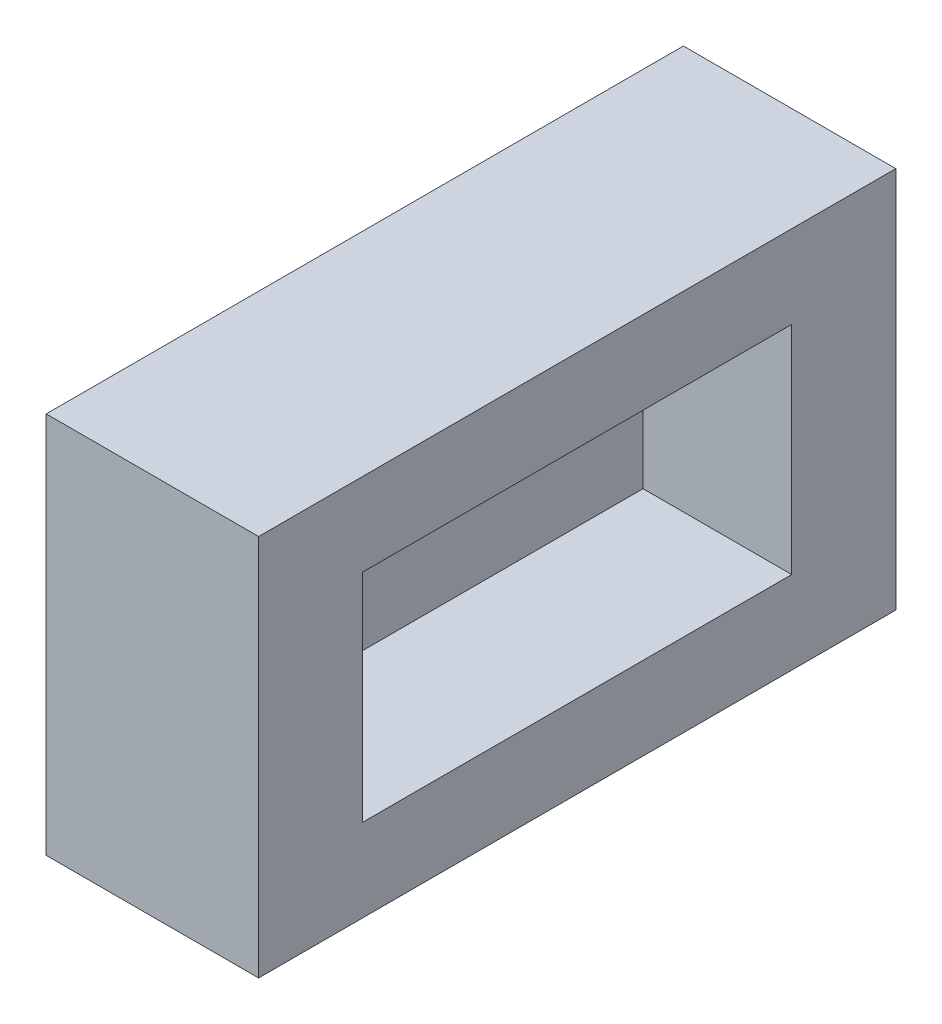
ISO-10303-21;
HEADER;
FILE_DESCRIPTION(('STEP AP214'),'2;1');
FILE_NAME('part.step','',(''),(''),'','','');
FILE_SCHEMA(('AUTOMOTIVE_DESIGN { 1 0 10303 214 1 1 1 1 }'));
ENDSEC;
DATA;
#1=APPLICATION_CONTEXT('core data for automotive mechanical design processes');
#2=APPLICATION_PROTOCOL_DEFINITION('international standard','automotive_design',2000,#1);
#3=PRODUCT_CONTEXT('',#1,'mechanical');
#4=PRODUCT('Part','Part','',(#3));
#5=PRODUCT_RELATED_PRODUCT_CATEGORY('part','',(#4));
#6=PRODUCT_DEFINITION_FORMATION('','',#4);
#7=PRODUCT_DEFINITION_CONTEXT('part definition',#1,'design');
#8=PRODUCT_DEFINITION('design','',#6,#7);
#9=PRODUCT_DEFINITION_SHAPE('','',#8);
#10=(LENGTH_UNIT() NAMED_UNIT(*) SI_UNIT(.MILLI.,.METRE.));
#11=(NAMED_UNIT(*) PLANE_ANGLE_UNIT() SI_UNIT($,.RADIAN.));
#12=(NAMED_UNIT(*) SI_UNIT($,.STERADIAN.) SOLID_ANGLE_UNIT());
#13=UNCERTAINTY_MEASURE_WITH_UNIT(LENGTH_MEASURE(1.E-05),#10,'distance_accuracy_value','');
#14=(GEOMETRIC_REPRESENTATION_CONTEXT(3) GLOBAL_UNCERTAINTY_ASSIGNED_CONTEXT((#13)) GLOBAL_UNIT_ASSIGNED_CONTEXT((#10,
#11,#12)) REPRESENTATION_CONTEXT('',''));
#15=CARTESIAN_POINT('',(0.,0.,0.));
#16=DIRECTION('',(0.,0.,1.));
#17=DIRECTION('',(1.,0.,0.));
#18=AXIS2_PLACEMENT_3D('',#15,#16,#17);
#19=CARTESIAN_POINT('',(-5.,18.,15.));
#20=DIRECTION('',(1.,0.,0.));
#21=DIRECTION('',(0.,0.,-1.));
#22=AXIS2_PLACEMENT_3D('',#19,#20,#21);
#23=PLANE('',#22);
#24=DIRECTION('',(0.,0.,1.));
#25=VECTOR('',#24,1.);
#26=CARTESIAN_POINT('',(-5.,0.,15.));
#27=LINE('',#26,#25);
#28=CARTESIAN_POINT('',(-5.,0.,-15.));
#29=VERTEX_POINT('',#28);
#30=CARTESIAN_POINT('',(-5.,0.,15.));
#31=VERTEX_POINT('',#30);
#32=EDGE_CURVE('E142',#29,#31,#27,.T.);
#33=ORIENTED_EDGE('',*,*,#32,.T.);
#34=DIRECTION('',(0.,-1.,0.));
#35=VECTOR('',#34,1.);
#36=CARTESIAN_POINT('',(-5.,18.,15.));
#37=LINE('',#36,#35);
#38=CARTESIAN_POINT('',(-5.,18.,15.));
#39=VERTEX_POINT('',#38);
#40=EDGE_CURVE('E11',#39,#31,#37,.T.);
#41=ORIENTED_EDGE('',*,*,#40,.F.);
#42=DIRECTION('',(0.,0.,1.));
#43=VECTOR('',#42,1.);
#44=CARTESIAN_POINT('',(-5.,18.,15.));
#45=LINE('',#44,#43);
#46=CARTESIAN_POINT('',(-5.,18.,-15.));
#47=VERTEX_POINT('',#46);
#48=EDGE_CURVE('E146',#47,#39,#45,.T.);
#49=ORIENTED_EDGE('',*,*,#48,.F.);
#50=DIRECTION('',(0.,-1.,0.));
#51=VECTOR('',#50,1.);
#52=CARTESIAN_POINT('',(-5.,18.,-15.));
#53=LINE('',#52,#51);
#54=EDGE_CURVE('E152',#47,#29,#53,.T.);
#55=ORIENTED_EDGE('',*,*,#54,.T.);
#56=EDGE_LOOP('',(#33,#41,#49,#55));
#57=FACE_BOUND('',#56,.T.);
#58=ADVANCED_FACE('F34',(#57),#23,.F.);
#59=CARTESIAN_POINT('',(5.,18.,15.));
#60=DIRECTION('',(0.,0.,-1.));
#61=DIRECTION('',(-1.,0.,0.));
#62=AXIS2_PLACEMENT_3D('',#59,#60,#61);
#63=PLANE('',#62);
#64=DIRECTION('',(1.,0.,0.));
#65=VECTOR('',#64,1.);
#66=CARTESIAN_POINT('',(5.,0.,15.));
#67=LINE('',#66,#65);
#68=CARTESIAN_POINT('',(5.,0.,15.));
#69=VERTEX_POINT('',#68);
#70=EDGE_CURVE('E155',#31,#69,#67,.T.);
#71=ORIENTED_EDGE('',*,*,#70,.T.);
#72=DIRECTION('',(0.,-1.,0.));
#73=VECTOR('',#72,1.);
#74=CARTESIAN_POINT('',(5.,18.,15.));
#75=LINE('',#74,#73);
#76=CARTESIAN_POINT('',(5.,18.,15.));
#77=VERTEX_POINT('',#76);
#78=EDGE_CURVE('E41',#77,#69,#75,.T.);
#79=ORIENTED_EDGE('',*,*,#78,.F.);
#80=DIRECTION('',(1.,0.,0.));
#81=VECTOR('',#80,1.);
#82=CARTESIAN_POINT('',(5.,18.,15.));
#83=LINE('',#82,#81);
#84=EDGE_CURVE('E85',#39,#77,#83,.T.);
#85=ORIENTED_EDGE('',*,*,#84,.F.);
#86=ORIENTED_EDGE('',*,*,#40,.T.);
#87=EDGE_LOOP('',(#71,#79,#85,#86));
#88=FACE_BOUND('',#87,.T.);
#89=ADVANCED_FACE('F183',(#88),#63,.F.);
#90=CARTESIAN_POINT('',(5.,18.,15.));
#91=DIRECTION('',(-1.,0.,0.));
#92=DIRECTION('',(0.,0.,1.));
#93=AXIS2_PLACEMENT_3D('',#90,#91,#92);
#94=PLANE('',#93);
#95=DIRECTION('',(0.,0.,1.));
#96=VECTOR('',#95,1.);
#97=CARTESIAN_POINT('',(5.,14.1,10.1));
#98=LINE('',#97,#96);
#99=CARTESIAN_POINT('',(5.,14.1,-10.1));
#100=VERTEX_POINT('',#99);
#101=CARTESIAN_POINT('',(5.,14.1,10.1));
#102=VERTEX_POINT('',#101);
#103=EDGE_CURVE('E136',#100,#102,#98,.T.);
#104=ORIENTED_EDGE('',*,*,#103,.F.);
#105=DIRECTION('',(0.,1.,0.));
#106=VECTOR('',#105,1.);
#107=CARTESIAN_POINT('',(5.,3.9,-10.1));
#108=LINE('',#107,#106);
#109=CARTESIAN_POINT('',(5.,3.9,-10.1));
#110=VERTEX_POINT('',#109);
#111=EDGE_CURVE('E48',#110,#100,#108,.T.);
#112=ORIENTED_EDGE('',*,*,#111,.F.);
#113=DIRECTION('',(0.,0.,-1.));
#114=VECTOR('',#113,1.);
#115=CARTESIAN_POINT('',(5.,3.9,10.1));
#116=LINE('',#115,#114);
#117=CARTESIAN_POINT('',(5.,3.9,10.1));
#118=VERTEX_POINT('',#117);
#119=EDGE_CURVE('E127',#118,#110,#116,.T.);
#120=ORIENTED_EDGE('',*,*,#119,.F.);
#121=DIRECTION('',(0.,-1.,0.));
#122=VECTOR('',#121,1.);
#123=CARTESIAN_POINT('',(5.,3.9,10.1));
#124=LINE('',#123,#122);
#125=EDGE_CURVE('E130',#102,#118,#124,.T.);
#126=ORIENTED_EDGE('',*,*,#125,.F.);
#127=EDGE_LOOP('',(#104,#112,#120,#126));
#128=FACE_BOUND('',#127,.T.);
#129=DIRECTION('',(0.,0.,-1.));
#130=VECTOR('',#129,1.);
#131=CARTESIAN_POINT('',(5.,0.,15.));
#132=LINE('',#131,#130);
#133=CARTESIAN_POINT('',(5.,0.,-15.));
#134=VERTEX_POINT('',#133);
#135=EDGE_CURVE('E157',#69,#134,#132,.T.);
#136=ORIENTED_EDGE('',*,*,#135,.T.);
#137=DIRECTION('',(0.,-1.,0.));
#138=VECTOR('',#137,1.);
#139=CARTESIAN_POINT('',(5.,18.,-15.));
#140=LINE('',#139,#138);
#141=CARTESIAN_POINT('',(5.,18.,-15.));
#142=VERTEX_POINT('',#141);
#143=EDGE_CURVE('E161',#142,#134,#140,.T.);
#144=ORIENTED_EDGE('',*,*,#143,.F.);
#145=DIRECTION('',(0.,0.,-1.));
#146=VECTOR('',#145,1.);
#147=CARTESIAN_POINT('',(5.,18.,15.));
#148=LINE('',#147,#146);
#149=EDGE_CURVE('E149',#77,#142,#148,.T.);
#150=ORIENTED_EDGE('',*,*,#149,.F.);
#151=ORIENTED_EDGE('',*,*,#78,.T.);
#152=EDGE_LOOP('',(#136,#144,#150,#151));
#153=FACE_BOUND('',#152,.T.);
#154=ADVANCED_FACE('F166',(#128,#153),#94,.F.);
#155=CARTESIAN_POINT('',(5.,18.,-15.));
#156=DIRECTION('',(0.,0.,1.));
#157=DIRECTION('',(1.,0.,0.));
#158=AXIS2_PLACEMENT_3D('',#155,#156,#157);
#159=PLANE('',#158);
#160=DIRECTION('',(-1.,0.,0.));
#161=VECTOR('',#160,1.);
#162=CARTESIAN_POINT('',(5.,0.,-15.));
#163=LINE('',#162,#161);
#164=EDGE_CURVE('E78',#134,#29,#163,.T.);
#165=ORIENTED_EDGE('',*,*,#164,.T.);
#166=ORIENTED_EDGE('',*,*,#54,.F.);
#167=DIRECTION('',(-1.,0.,0.));
#168=VECTOR('',#167,1.);
#169=CARTESIAN_POINT('',(5.,18.,-15.));
#170=LINE('',#169,#168);
#171=EDGE_CURVE('E57',#142,#47,#170,.T.);
#172=ORIENTED_EDGE('',*,*,#171,.F.);
#173=ORIENTED_EDGE('',*,*,#143,.T.);
#174=EDGE_LOOP('',(#165,#166,#172,#173));
#175=FACE_BOUND('',#174,.T.);
#176=ADVANCED_FACE('F174',(#175),#159,.F.);
#177=CARTESIAN_POINT('',(0.,18.,0.));
#178=DIRECTION('',(0.,1.,0.));
#179=DIRECTION('',(0.,0.,1.));
#180=AXIS2_PLACEMENT_3D('',#177,#178,#179);
#181=PLANE('',#180);
#182=ORIENTED_EDGE('',*,*,#48,.T.);
#183=ORIENTED_EDGE('',*,*,#84,.T.);
#184=ORIENTED_EDGE('',*,*,#149,.T.);
#185=ORIENTED_EDGE('',*,*,#171,.T.);
#186=EDGE_LOOP('',(#182,#183,#184,#185));
#187=FACE_BOUND('',#186,.T.);
#188=ADVANCED_FACE('F176',(#187),#181,.T.);
#189=CARTESIAN_POINT('',(0.,0.,0.));
#190=DIRECTION('',(0.,1.,0.));
#191=DIRECTION('',(0.,0.,1.));
#192=AXIS2_PLACEMENT_3D('',#189,#190,#191);
#193=PLANE('',#192);
#194=ORIENTED_EDGE('',*,*,#32,.F.);
#195=ORIENTED_EDGE('',*,*,#164,.F.);
#196=ORIENTED_EDGE('',*,*,#135,.F.);
#197=ORIENTED_EDGE('',*,*,#70,.F.);
#198=EDGE_LOOP('',(#194,#195,#196,#197));
#199=FACE_BOUND('',#198,.T.);
#200=ADVANCED_FACE('F170',(#199),#193,.F.);
#201=CARTESIAN_POINT('',(-2.,3.9,-10.1));
#202=DIRECTION('',(0.,0.,-1.));
#203=DIRECTION('',(-1.,0.,0.));
#204=AXIS2_PLACEMENT_3D('',#201,#202,#203);
#205=PLANE('',#204);
#206=ORIENTED_EDGE('',*,*,#111,.T.);
#207=DIRECTION('',(1.,0.,0.));
#208=VECTOR('',#207,1.);
#209=CARTESIAN_POINT('',(-2.,14.1,-10.1));
#210=LINE('',#209,#208);
#211=CARTESIAN_POINT('',(-2.,14.1,-10.1));
#212=VERTEX_POINT('',#211);
#213=EDGE_CURVE('E105',#212,#100,#210,.T.);
#214=ORIENTED_EDGE('',*,*,#213,.F.);
#215=DIRECTION('',(0.,1.,0.));
#216=VECTOR('',#215,1.);
#217=CARTESIAN_POINT('',(-2.,3.9,-10.1));
#218=LINE('',#217,#216);
#219=CARTESIAN_POINT('',(-2.,3.9,-10.1));
#220=VERTEX_POINT('',#219);
#221=EDGE_CURVE('E109',#220,#212,#218,.T.);
#222=ORIENTED_EDGE('',*,*,#221,.F.);
#223=DIRECTION('',(1.,0.,0.));
#224=VECTOR('',#223,1.);
#225=CARTESIAN_POINT('',(-2.,3.9,-10.1));
#226=LINE('',#225,#224);
#227=EDGE_CURVE('E140',#220,#110,#226,.T.);
#228=ORIENTED_EDGE('',*,*,#227,.T.);
#229=EDGE_LOOP('',(#206,#214,#222,#228));
#230=FACE_BOUND('',#229,.T.);
#231=ADVANCED_FACE('F107',(#230),#205,.F.);
#232=CARTESIAN_POINT('',(-2.,3.9,10.1));
#233=DIRECTION('',(0.,-1.,0.));
#234=DIRECTION('',(0.,0.,-1.));
#235=AXIS2_PLACEMENT_3D('',#232,#233,#234);
#236=PLANE('',#235);
#237=ORIENTED_EDGE('',*,*,#119,.T.);
#238=ORIENTED_EDGE('',*,*,#227,.F.);
#239=DIRECTION('',(0.,0.,-1.));
#240=VECTOR('',#239,1.);
#241=CARTESIAN_POINT('',(-2.,3.9,10.1));
#242=LINE('',#241,#240);
#243=CARTESIAN_POINT('',(-2.,3.9,10.1));
#244=VERTEX_POINT('',#243);
#245=EDGE_CURVE('E115',#244,#220,#242,.T.);
#246=ORIENTED_EDGE('',*,*,#245,.F.);
#247=DIRECTION('',(1.,0.,0.));
#248=VECTOR('',#247,1.);
#249=CARTESIAN_POINT('',(-2.,3.9,10.1));
#250=LINE('',#249,#248);
#251=EDGE_CURVE('E143',#244,#118,#250,.T.);
#252=ORIENTED_EDGE('',*,*,#251,.T.);
#253=EDGE_LOOP('',(#237,#238,#246,#252));
#254=FACE_BOUND('',#253,.T.);
#255=ADVANCED_FACE('F212',(#254),#236,.F.);
#256=CARTESIAN_POINT('',(-2.,3.9,10.1));
#257=DIRECTION('',(0.,0.,1.));
#258=DIRECTION('',(1.,0.,0.));
#259=AXIS2_PLACEMENT_3D('',#256,#257,#258);
#260=PLANE('',#259);
#261=ORIENTED_EDGE('',*,*,#125,.T.);
#262=ORIENTED_EDGE('',*,*,#251,.F.);
#263=DIRECTION('',(0.,-1.,0.));
#264=VECTOR('',#263,1.);
#265=CARTESIAN_POINT('',(-2.,3.9,10.1));
#266=LINE('',#265,#264);
#267=CARTESIAN_POINT('',(-2.,14.1,10.1));
#268=VERTEX_POINT('',#267);
#269=EDGE_CURVE('E123',#268,#244,#266,.T.);
#270=ORIENTED_EDGE('',*,*,#269,.F.);
#271=DIRECTION('',(1.,0.,0.));
#272=VECTOR('',#271,1.);
#273=CARTESIAN_POINT('',(-2.,14.1,10.1));
#274=LINE('',#273,#272);
#275=EDGE_CURVE('E114',#268,#102,#274,.T.);
#276=ORIENTED_EDGE('',*,*,#275,.T.);
#277=EDGE_LOOP('',(#261,#262,#270,#276));
#278=FACE_BOUND('',#277,.T.);
#279=ADVANCED_FACE('F221',(#278),#260,.F.);
#280=CARTESIAN_POINT('',(-2.,14.1,10.1));
#281=DIRECTION('',(0.,1.,0.));
#282=DIRECTION('',(0.,0.,1.));
#283=AXIS2_PLACEMENT_3D('',#280,#281,#282);
#284=PLANE('',#283);
#285=ORIENTED_EDGE('',*,*,#103,.T.);
#286=ORIENTED_EDGE('',*,*,#275,.F.);
#287=DIRECTION('',(0.,0.,1.));
#288=VECTOR('',#287,1.);
#289=CARTESIAN_POINT('',(-2.,14.1,10.1));
#290=LINE('',#289,#288);
#291=EDGE_CURVE('E118',#212,#268,#290,.T.);
#292=ORIENTED_EDGE('',*,*,#291,.F.);
#293=ORIENTED_EDGE('',*,*,#213,.T.);
#294=EDGE_LOOP('',(#285,#286,#292,#293));
#295=FACE_BOUND('',#294,.T.);
#296=ADVANCED_FACE('F119',(#295),#284,.F.);
#297=CARTESIAN_POINT('',(-2.,0.,0.));
#298=DIRECTION('',(-1.,0.,0.));
#299=DIRECTION('',(0.,0.,1.));
#300=AXIS2_PLACEMENT_3D('',#297,#298,#299);
#301=PLANE('',#300);
#302=ORIENTED_EDGE('',*,*,#221,.T.);
#303=ORIENTED_EDGE('',*,*,#291,.T.);
#304=ORIENTED_EDGE('',*,*,#269,.T.);
#305=ORIENTED_EDGE('',*,*,#245,.T.);
#306=EDGE_LOOP('',(#302,#303,#304,#305));
#307=FACE_BOUND('',#306,.T.);
#308=ADVANCED_FACE('F125',(#307),#301,.F.);
#309=CLOSED_SHELL('',(#58,#89,#154,#176,#188,#200,#231,#255,#279,#296,#308));
#310=MANIFOLD_SOLID_BREP('B2',#309);
#311=ADVANCED_BREP_SHAPE_REPRESENTATION('',(#18,#310),#14);
#312=SHAPE_DEFINITION_REPRESENTATION(#9,#311);
ENDSEC;
END-ISO-10303-21;
